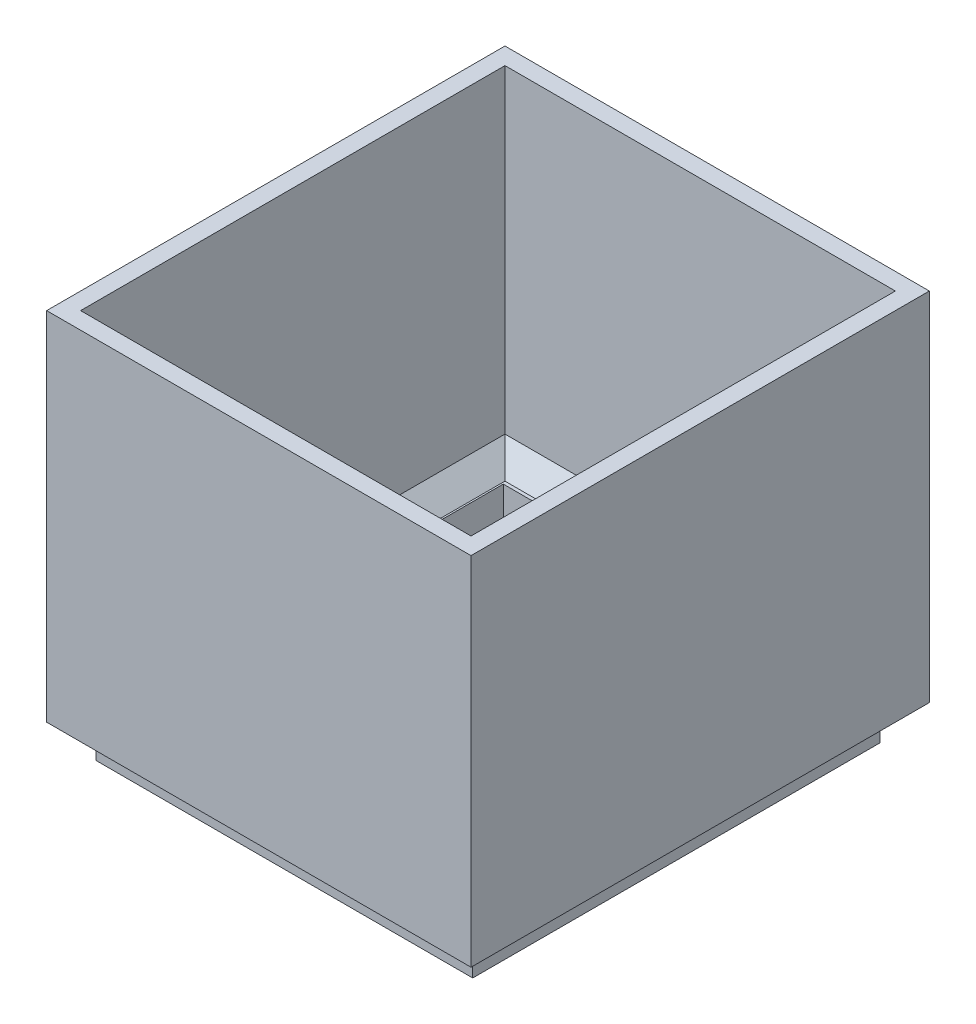
ISO-10303-21;
HEADER;
FILE_DESCRIPTION(('STEP AP214'),'2;1');
FILE_NAME('part.step','',(''),(''),'','','');
FILE_SCHEMA(('AUTOMOTIVE_DESIGN { 1 0 10303 214 1 1 1 1 }'));
ENDSEC;
DATA;
#1=APPLICATION_CONTEXT('core data for automotive mechanical design processes');
#2=APPLICATION_PROTOCOL_DEFINITION('international standard','automotive_design',2000,#1);
#3=PRODUCT_CONTEXT('',#1,'mechanical');
#4=PRODUCT('Part','Part','',(#3));
#5=PRODUCT_RELATED_PRODUCT_CATEGORY('part','',(#4));
#6=PRODUCT_DEFINITION_FORMATION('','',#4);
#7=PRODUCT_DEFINITION_CONTEXT('part definition',#1,'design');
#8=PRODUCT_DEFINITION('design','',#6,#7);
#9=PRODUCT_DEFINITION_SHAPE('','',#8);
#10=(LENGTH_UNIT() NAMED_UNIT(*) SI_UNIT(.MILLI.,.METRE.));
#11=(NAMED_UNIT(*) PLANE_ANGLE_UNIT() SI_UNIT($,.RADIAN.));
#12=(NAMED_UNIT(*) SI_UNIT($,.STERADIAN.) SOLID_ANGLE_UNIT());
#13=UNCERTAINTY_MEASURE_WITH_UNIT(LENGTH_MEASURE(1.E-05),#10,'distance_accuracy_value','');
#14=(GEOMETRIC_REPRESENTATION_CONTEXT(3) GLOBAL_UNCERTAINTY_ASSIGNED_CONTEXT((#13)) GLOBAL_UNIT_ASSIGNED_CONTEXT((#10,
#11,#12)) REPRESENTATION_CONTEXT('',''));
#15=CARTESIAN_POINT('',(0.,0.,0.));
#16=DIRECTION('',(0.,0.,1.));
#17=DIRECTION('',(1.,0.,0.));
#18=AXIS2_PLACEMENT_3D('',#15,#16,#17);
#19=CARTESIAN_POINT('',(0.,15.,0.));
#20=DIRECTION('',(0.,1.,0.));
#21=DIRECTION('',(0.,0.,1.));
#22=AXIS2_PLACEMENT_3D('',#19,#20,#21);
#23=PLANE('',#22);
#24=DIRECTION('',(1.,0.,0.));
#25=VECTOR('',#24,1.);
#26=CARTESIAN_POINT('',(57.5,15.,56.5));
#27=LINE('',#26,#25);
#28=CARTESIAN_POINT('',(-51.5,15.,56.5));
#29=VERTEX_POINT('',#28);
#30=CARTESIAN_POINT('',(51.5,15.,56.5));
#31=VERTEX_POINT('',#30);
#32=EDGE_CURVE('E347',#29,#31,#27,.T.);
#33=ORIENTED_EDGE('',*,*,#32,.T.);
#34=DIRECTION('',(0.,0.,-1.));
#35=VECTOR('',#34,1.);
#36=CARTESIAN_POINT('',(51.5,15.,-62.5));
#37=LINE('',#36,#35);
#38=CARTESIAN_POINT('',(51.5,15.,-56.5));
#39=VERTEX_POINT('',#38);
#40=EDGE_CURVE('E350',#31,#39,#37,.T.);
#41=ORIENTED_EDGE('',*,*,#40,.T.);
#42=DIRECTION('',(-1.,0.,0.));
#43=VECTOR('',#42,1.);
#44=CARTESIAN_POINT('',(-57.5,15.,-56.5));
#45=LINE('',#44,#43);
#46=CARTESIAN_POINT('',(-51.5,15.,-56.5));
#47=VERTEX_POINT('',#46);
#48=EDGE_CURVE('E341',#39,#47,#45,.T.);
#49=ORIENTED_EDGE('',*,*,#48,.T.);
#50=DIRECTION('',(0.,0.,1.));
#51=VECTOR('',#50,1.);
#52=CARTESIAN_POINT('',(-51.5,15.,62.5));
#53=LINE('',#52,#51);
#54=EDGE_CURVE('E344',#47,#29,#53,.T.);
#55=ORIENTED_EDGE('',*,*,#54,.T.);
#56=EDGE_LOOP('',(#33,#41,#49,#55));
#57=FACE_BOUND('',#56,.T.);
#58=DIRECTION('',(-1.,0.,0.));
#59=VECTOR('',#58,1.);
#60=CARTESIAN_POINT('',(-51.,15.,-55.5));
#61=LINE('',#60,#59);
#62=CARTESIAN_POINT('',(51.,15.,-55.5));
#63=VERTEX_POINT('',#62);
#64=CARTESIAN_POINT('',(-51.,15.,-55.5));
#65=VERTEX_POINT('',#64);
#66=EDGE_CURVE('E225',#63,#65,#61,.T.);
#67=ORIENTED_EDGE('',*,*,#66,.F.);
#68=DIRECTION('',(0.,0.,-1.));
#69=VECTOR('',#68,1.);
#70=CARTESIAN_POINT('',(51.,15.,-55.5));
#71=LINE('',#70,#69);
#72=CARTESIAN_POINT('',(51.,15.,55.5));
#73=VERTEX_POINT('',#72);
#74=EDGE_CURVE('E221',#73,#63,#71,.T.);
#75=ORIENTED_EDGE('',*,*,#74,.F.);
#76=DIRECTION('',(1.,0.,0.));
#77=VECTOR('',#76,1.);
#78=CARTESIAN_POINT('',(-51.,15.,55.5));
#79=LINE('',#78,#77);
#80=CARTESIAN_POINT('',(-51.,15.,55.5));
#81=VERTEX_POINT('',#80);
#82=EDGE_CURVE('E233',#81,#73,#79,.T.);
#83=ORIENTED_EDGE('',*,*,#82,.F.);
#84=DIRECTION('',(0.,0.,1.));
#85=VECTOR('',#84,1.);
#86=CARTESIAN_POINT('',(-51.,15.,-55.5));
#87=LINE('',#86,#85);
#88=EDGE_CURVE('E229',#65,#81,#87,.T.);
#89=ORIENTED_EDGE('',*,*,#88,.F.);
#90=EDGE_LOOP('',(#67,#75,#83,#89));
#91=FACE_BOUND('',#90,.T.);
#92=ADVANCED_FACE('F42',(#57,#91),#23,.T.);
#93=CARTESIAN_POINT('',(0.,0.,0.));
#94=DIRECTION('',(0.,1.,0.));
#95=DIRECTION('',(0.,0.,1.));
#96=AXIS2_PLACEMENT_3D('',#93,#94,#95);
#97=PLANE('',#96);
#98=DIRECTION('',(0.,0.,-1.));
#99=VECTOR('',#98,1.);
#100=CARTESIAN_POINT('',(55.5,0.,-60.));
#101=LINE('',#100,#99);
#102=CARTESIAN_POINT('',(55.5,0.,60.));
#103=VERTEX_POINT('',#102);
#104=CARTESIAN_POINT('',(55.5,0.,-60.));
#105=VERTEX_POINT('',#104);
#106=EDGE_CURVE('E296',#103,#105,#101,.T.);
#107=ORIENTED_EDGE('',*,*,#106,.F.);
#108=DIRECTION('',(1.,0.,0.));
#109=VECTOR('',#108,1.);
#110=CARTESIAN_POINT('',(-55.5,0.,60.));
#111=LINE('',#110,#109);
#112=CARTESIAN_POINT('',(-55.5,0.,60.));
#113=VERTEX_POINT('',#112);
#114=EDGE_CURVE('E302',#113,#103,#111,.T.);
#115=ORIENTED_EDGE('',*,*,#114,.F.);
#116=DIRECTION('',(0.,0.,1.));
#117=VECTOR('',#116,1.);
#118=CARTESIAN_POINT('',(-55.5,0.,-60.));
#119=LINE('',#118,#117);
#120=CARTESIAN_POINT('',(-55.5,0.,-60.));
#121=VERTEX_POINT('',#120);
#122=EDGE_CURVE('E321',#121,#113,#119,.T.);
#123=ORIENTED_EDGE('',*,*,#122,.F.);
#124=DIRECTION('',(-1.,0.,0.));
#125=VECTOR('',#124,1.);
#126=CARTESIAN_POINT('',(-55.5,0.,-60.));
#127=LINE('',#126,#125);
#128=EDGE_CURVE('E318',#105,#121,#127,.T.);
#129=ORIENTED_EDGE('',*,*,#128,.F.);
#130=EDGE_LOOP('',(#107,#115,#123,#129));
#131=FACE_BOUND('',#130,.T.);
#132=DIRECTION('',(0.,0.,-1.));
#133=VECTOR('',#132,1.);
#134=CARTESIAN_POINT('',(51.,0.,-55.5));
#135=LINE('',#134,#133);
#136=CARTESIAN_POINT('',(51.,0.,55.5));
#137=VERTEX_POINT('',#136);
#138=CARTESIAN_POINT('',(51.,0.,-55.5));
#139=VERTEX_POINT('',#138);
#140=EDGE_CURVE('E266',#137,#139,#135,.T.);
#141=ORIENTED_EDGE('',*,*,#140,.T.);
#142=DIRECTION('',(-1.,0.,0.));
#143=VECTOR('',#142,1.);
#144=CARTESIAN_POINT('',(-51.,0.,-55.5));
#145=LINE('',#144,#143);
#146=CARTESIAN_POINT('',(-51.,0.,-55.5));
#147=VERTEX_POINT('',#146);
#148=EDGE_CURVE('E270',#139,#147,#145,.T.);
#149=ORIENTED_EDGE('',*,*,#148,.T.);
#150=DIRECTION('',(0.,0.,1.));
#151=VECTOR('',#150,1.);
#152=CARTESIAN_POINT('',(-51.,0.,-55.5));
#153=LINE('',#152,#151);
#154=CARTESIAN_POINT('',(-51.,0.,55.5));
#155=VERTEX_POINT('',#154);
#156=EDGE_CURVE('E274',#147,#155,#153,.T.);
#157=ORIENTED_EDGE('',*,*,#156,.T.);
#158=DIRECTION('',(1.,0.,0.));
#159=VECTOR('',#158,1.);
#160=CARTESIAN_POINT('',(-51.,0.,55.5));
#161=LINE('',#160,#159);
#162=EDGE_CURVE('E278',#155,#137,#161,.T.);
#163=ORIENTED_EDGE('',*,*,#162,.T.);
#164=EDGE_LOOP('',(#141,#149,#157,#163));
#165=FACE_BOUND('',#164,.T.);
#166=ADVANCED_FACE('F396',(#131,#165),#97,.F.);
#167=CARTESIAN_POINT('',(55.5,10.,-60.));
#168=DIRECTION('',(-1.,0.,0.));
#169=DIRECTION('',(0.,0.,1.));
#170=AXIS2_PLACEMENT_3D('',#167,#168,#169);
#171=PLANE('',#170);
#172=ORIENTED_EDGE('',*,*,#106,.T.);
#173=DIRECTION('',(0.,-1.,0.));
#174=VECTOR('',#173,1.);
#175=CARTESIAN_POINT('',(55.5,10.,-60.));
#176=LINE('',#175,#174);
#177=CARTESIAN_POINT('',(55.5,10.,-60.));
#178=VERTEX_POINT('',#177);
#179=EDGE_CURVE('E337',#178,#105,#176,.T.);
#180=ORIENTED_EDGE('',*,*,#179,.F.);
#181=DIRECTION('',(0.,0.,-1.));
#182=VECTOR('',#181,1.);
#183=CARTESIAN_POINT('',(55.5,10.,-60.));
#184=LINE('',#183,#182);
#185=CARTESIAN_POINT('',(55.5,10.,60.));
#186=VERTEX_POINT('',#185);
#187=EDGE_CURVE('E297',#186,#178,#184,.T.);
#188=ORIENTED_EDGE('',*,*,#187,.F.);
#189=DIRECTION('',(0.,-1.,0.));
#190=VECTOR('',#189,1.);
#191=CARTESIAN_POINT('',(55.5,10.,60.));
#192=LINE('',#191,#190);
#193=EDGE_CURVE('E314',#186,#103,#192,.T.);
#194=ORIENTED_EDGE('',*,*,#193,.T.);
#195=EDGE_LOOP('',(#172,#180,#188,#194));
#196=FACE_BOUND('',#195,.T.);
#197=ADVANCED_FACE('F414',(#196),#171,.F.);
#198=CARTESIAN_POINT('',(-55.5,10.,-60.));
#199=DIRECTION('',(0.,0.,1.));
#200=DIRECTION('',(1.,0.,0.));
#201=AXIS2_PLACEMENT_3D('',#198,#199,#200);
#202=PLANE('',#201);
#203=ORIENTED_EDGE('',*,*,#128,.T.);
#204=DIRECTION('',(0.,-1.,0.));
#205=VECTOR('',#204,1.);
#206=CARTESIAN_POINT('',(-55.5,10.,-60.));
#207=LINE('',#206,#205);
#208=CARTESIAN_POINT('',(-55.5,10.,-60.));
#209=VERTEX_POINT('',#208);
#210=EDGE_CURVE('E333',#209,#121,#207,.T.);
#211=ORIENTED_EDGE('',*,*,#210,.F.);
#212=DIRECTION('',(-1.,0.,0.));
#213=VECTOR('',#212,1.);
#214=CARTESIAN_POINT('',(-55.5,10.,-60.));
#215=LINE('',#214,#213);
#216=EDGE_CURVE('E301',#178,#209,#215,.T.);
#217=ORIENTED_EDGE('',*,*,#216,.F.);
#218=ORIENTED_EDGE('',*,*,#179,.T.);
#219=EDGE_LOOP('',(#203,#211,#217,#218));
#220=FACE_BOUND('',#219,.T.);
#221=ADVANCED_FACE('F421',(#220),#202,.F.);
#222=CARTESIAN_POINT('',(-55.5,10.,-60.));
#223=DIRECTION('',(1.,0.,0.));
#224=DIRECTION('',(0.,0.,-1.));
#225=AXIS2_PLACEMENT_3D('',#222,#223,#224);
#226=PLANE('',#225);
#227=ORIENTED_EDGE('',*,*,#122,.T.);
#228=DIRECTION('',(0.,-1.,0.));
#229=VECTOR('',#228,1.);
#230=CARTESIAN_POINT('',(-55.5,10.,60.));
#231=LINE('',#230,#229);
#232=CARTESIAN_POINT('',(-55.5,10.,60.));
#233=VERTEX_POINT('',#232);
#234=EDGE_CURVE('E329',#233,#113,#231,.T.);
#235=ORIENTED_EDGE('',*,*,#234,.F.);
#236=DIRECTION('',(0.,0.,1.));
#237=VECTOR('',#236,1.);
#238=CARTESIAN_POINT('',(-55.5,10.,-60.));
#239=LINE('',#238,#237);
#240=EDGE_CURVE('E306',#209,#233,#239,.T.);
#241=ORIENTED_EDGE('',*,*,#240,.F.);
#242=ORIENTED_EDGE('',*,*,#210,.T.);
#243=EDGE_LOOP('',(#227,#235,#241,#242));
#244=FACE_BOUND('',#243,.T.);
#245=ADVANCED_FACE('F431',(#244),#226,.F.);
#246=CARTESIAN_POINT('',(-55.5,10.,60.));
#247=DIRECTION('',(0.,0.,-1.));
#248=DIRECTION('',(-1.,0.,0.));
#249=AXIS2_PLACEMENT_3D('',#246,#247,#248);
#250=PLANE('',#249);
#251=ORIENTED_EDGE('',*,*,#114,.T.);
#252=ORIENTED_EDGE('',*,*,#193,.F.);
#253=DIRECTION('',(1.,0.,0.));
#254=VECTOR('',#253,1.);
#255=CARTESIAN_POINT('',(-55.5,10.,60.));
#256=LINE('',#255,#254);
#257=EDGE_CURVE('E310',#233,#186,#256,.T.);
#258=ORIENTED_EDGE('',*,*,#257,.F.);
#259=ORIENTED_EDGE('',*,*,#234,.T.);
#260=EDGE_LOOP('',(#251,#252,#258,#259));
#261=FACE_BOUND('',#260,.T.);
#262=ADVANCED_FACE('F428',(#261),#250,.F.);
#263=CARTESIAN_POINT('',(51.,10.,-55.5));
#264=DIRECTION('',(-1.,0.,0.));
#265=DIRECTION('',(0.,0.,1.));
#266=AXIS2_PLACEMENT_3D('',#263,#264,#265);
#267=PLANE('',#266);
#268=ORIENTED_EDGE('',*,*,#140,.F.);
#269=DIRECTION('',(0.,-1.,0.));
#270=VECTOR('',#269,1.);
#271=CARTESIAN_POINT('',(51.,10.,55.5));
#272=LINE('',#271,#270);
#273=EDGE_CURVE('E282',#73,#137,#272,.T.);
#274=ORIENTED_EDGE('',*,*,#273,.F.);
#275=ORIENTED_EDGE('',*,*,#74,.T.);
#276=DIRECTION('',(0.,-1.,0.));
#277=VECTOR('',#276,1.);
#278=CARTESIAN_POINT('',(51.,10.,-55.5));
#279=LINE('',#278,#277);
#280=EDGE_CURVE('E292',#63,#139,#279,.T.);
#281=ORIENTED_EDGE('',*,*,#280,.T.);
#282=EDGE_LOOP('',(#268,#274,#275,#281));
#283=FACE_BOUND('',#282,.T.);
#284=ADVANCED_FACE('F406',(#283),#267,.T.);
#285=CARTESIAN_POINT('',(-51.,10.,-55.5));
#286=DIRECTION('',(0.,0.,1.));
#287=DIRECTION('',(1.,0.,0.));
#288=AXIS2_PLACEMENT_3D('',#285,#286,#287);
#289=PLANE('',#288);
#290=ORIENTED_EDGE('',*,*,#148,.F.);
#291=ORIENTED_EDGE('',*,*,#280,.F.);
#292=ORIENTED_EDGE('',*,*,#66,.T.);
#293=DIRECTION('',(0.,-1.,0.));
#294=VECTOR('',#293,1.);
#295=CARTESIAN_POINT('',(-51.,10.,-55.5));
#296=LINE('',#295,#294);
#297=EDGE_CURVE('E289',#65,#147,#296,.T.);
#298=ORIENTED_EDGE('',*,*,#297,.T.);
#299=EDGE_LOOP('',(#290,#291,#292,#298));
#300=FACE_BOUND('',#299,.T.);
#301=ADVANCED_FACE('F403',(#300),#289,.T.);
#302=CARTESIAN_POINT('',(-51.,10.,-55.5));
#303=DIRECTION('',(1.,0.,0.));
#304=DIRECTION('',(0.,0.,-1.));
#305=AXIS2_PLACEMENT_3D('',#302,#303,#304);
#306=PLANE('',#305);
#307=ORIENTED_EDGE('',*,*,#156,.F.);
#308=ORIENTED_EDGE('',*,*,#297,.F.);
#309=ORIENTED_EDGE('',*,*,#88,.T.);
#310=DIRECTION('',(0.,-1.,0.));
#311=VECTOR('',#310,1.);
#312=CARTESIAN_POINT('',(-51.,10.,55.5));
#313=LINE('',#312,#311);
#314=EDGE_CURVE('E286',#81,#155,#313,.T.);
#315=ORIENTED_EDGE('',*,*,#314,.T.);
#316=EDGE_LOOP('',(#307,#308,#309,#315));
#317=FACE_BOUND('',#316,.T.);
#318=ADVANCED_FACE('F411',(#317),#306,.T.);
#319=CARTESIAN_POINT('',(-51.,10.,55.5));
#320=DIRECTION('',(0.,0.,-1.));
#321=DIRECTION('',(-1.,0.,0.));
#322=AXIS2_PLACEMENT_3D('',#319,#320,#321);
#323=PLANE('',#322);
#324=ORIENTED_EDGE('',*,*,#162,.F.);
#325=ORIENTED_EDGE('',*,*,#314,.F.);
#326=ORIENTED_EDGE('',*,*,#82,.T.);
#327=ORIENTED_EDGE('',*,*,#273,.T.);
#328=EDGE_LOOP('',(#324,#325,#326,#327));
#329=FACE_BOUND('',#328,.T.);
#330=ADVANCED_FACE('F409',(#329),#323,.T.);
#331=CARTESIAN_POINT('',(0.,10.,0.));
#332=DIRECTION('',(0.,1.,0.));
#333=DIRECTION('',(0.,0.,1.));
#334=AXIS2_PLACEMENT_3D('',#331,#332,#333);
#335=PLANE('',#334);
#336=DIRECTION('',(0.,0.,-1.));
#337=VECTOR('',#336,1.);
#338=CARTESIAN_POINT('',(62.5,10.,-67.5));
#339=LINE('',#338,#337);
#340=CARTESIAN_POINT('',(62.5,10.,67.5));
#341=VERTEX_POINT('',#340);
#342=CARTESIAN_POINT('',(62.5,10.,-67.5));
#343=VERTEX_POINT('',#342);
#344=EDGE_CURVE('E237',#341,#343,#339,.T.);
#345=ORIENTED_EDGE('',*,*,#344,.F.);
#346=DIRECTION('',(1.,0.,0.));
#347=VECTOR('',#346,1.);
#348=CARTESIAN_POINT('',(-62.5,10.,67.5));
#349=LINE('',#348,#347);
#350=CARTESIAN_POINT('',(-62.5,10.,67.5));
#351=VERTEX_POINT('',#350);
#352=EDGE_CURVE('E247',#351,#341,#349,.T.);
#353=ORIENTED_EDGE('',*,*,#352,.F.);
#354=DIRECTION('',(0.,0.,1.));
#355=VECTOR('',#354,1.);
#356=CARTESIAN_POINT('',(-62.5,10.,-67.5));
#357=LINE('',#356,#355);
#358=CARTESIAN_POINT('',(-62.5,10.,-67.5));
#359=VERTEX_POINT('',#358);
#360=EDGE_CURVE('E244',#359,#351,#357,.T.);
#361=ORIENTED_EDGE('',*,*,#360,.F.);
#362=DIRECTION('',(-1.,0.,0.));
#363=VECTOR('',#362,1.);
#364=CARTESIAN_POINT('',(-62.5,10.,-67.5));
#365=LINE('',#364,#363);
#366=EDGE_CURVE('E241',#343,#359,#365,.T.);
#367=ORIENTED_EDGE('',*,*,#366,.F.);
#368=EDGE_LOOP('',(#345,#353,#361,#367));
#369=FACE_BOUND('',#368,.T.);
#370=ORIENTED_EDGE('',*,*,#257,.T.);
#371=ORIENTED_EDGE('',*,*,#187,.T.);
#372=ORIENTED_EDGE('',*,*,#216,.T.);
#373=ORIENTED_EDGE('',*,*,#240,.T.);
#374=EDGE_LOOP('',(#370,#371,#372,#373));
#375=FACE_BOUND('',#374,.T.);
#376=ADVANCED_FACE('F472',(#369,#375),#335,.F.);
#377=CARTESIAN_POINT('',(62.5,15.,-67.5));
#378=DIRECTION('',(-1.,0.,0.));
#379=DIRECTION('',(0.,0.,1.));
#380=AXIS2_PLACEMENT_3D('',#377,#378,#379);
#381=PLANE('',#380);
#382=ORIENTED_EDGE('',*,*,#344,.T.);
#383=DIRECTION('',(0.,-1.,0.));
#384=VECTOR('',#383,1.);
#385=CARTESIAN_POINT('',(62.5,15.,-67.5));
#386=LINE('',#385,#384);
#387=CARTESIAN_POINT('',(62.5,115.,-67.5));
#388=VERTEX_POINT('',#387);
#389=EDGE_CURVE('E262',#388,#343,#386,.T.);
#390=ORIENTED_EDGE('',*,*,#389,.F.);
#391=DIRECTION('',(0.,0.,-1.));
#392=VECTOR('',#391,1.);
#393=CARTESIAN_POINT('',(62.5,115.,-67.5));
#394=LINE('',#393,#392);
#395=CARTESIAN_POINT('',(62.5,115.,67.5));
#396=VERTEX_POINT('',#395);
#397=EDGE_CURVE('E213',#396,#388,#394,.T.);
#398=ORIENTED_EDGE('',*,*,#397,.F.);
#399=DIRECTION('',(0.,-1.,0.));
#400=VECTOR('',#399,1.);
#401=CARTESIAN_POINT('',(62.5,15.,67.5));
#402=LINE('',#401,#400);
#403=EDGE_CURVE('E250',#396,#341,#402,.T.);
#404=ORIENTED_EDGE('',*,*,#403,.T.);
#405=EDGE_LOOP('',(#382,#390,#398,#404));
#406=FACE_BOUND('',#405,.T.);
#407=ADVANCED_FACE('F475',(#406),#381,.F.);
#408=CARTESIAN_POINT('',(-62.5,15.,-67.5));
#409=DIRECTION('',(0.,0.,1.));
#410=DIRECTION('',(1.,0.,0.));
#411=AXIS2_PLACEMENT_3D('',#408,#409,#410);
#412=PLANE('',#411);
#413=ORIENTED_EDGE('',*,*,#366,.T.);
#414=DIRECTION('',(0.,-1.,0.));
#415=VECTOR('',#414,1.);
#416=CARTESIAN_POINT('',(-62.5,15.,-67.5));
#417=LINE('',#416,#415);
#418=CARTESIAN_POINT('',(-62.5,115.,-67.5));
#419=VERTEX_POINT('',#418);
#420=EDGE_CURVE('E258',#419,#359,#417,.T.);
#421=ORIENTED_EDGE('',*,*,#420,.F.);
#422=DIRECTION('',(-1.,0.,0.));
#423=VECTOR('',#422,1.);
#424=CARTESIAN_POINT('',(62.5,115.,-67.5));
#425=LINE('',#424,#423);
#426=EDGE_CURVE('E217',#388,#419,#425,.T.);
#427=ORIENTED_EDGE('',*,*,#426,.F.);
#428=ORIENTED_EDGE('',*,*,#389,.T.);
#429=EDGE_LOOP('',(#413,#421,#427,#428));
#430=FACE_BOUND('',#429,.T.);
#431=ADVANCED_FACE('F483',(#430),#412,.F.);
#432=CARTESIAN_POINT('',(-62.5,15.,-67.5));
#433=DIRECTION('',(1.,0.,0.));
#434=DIRECTION('',(0.,0.,-1.));
#435=AXIS2_PLACEMENT_3D('',#432,#433,#434);
#436=PLANE('',#435);
#437=ORIENTED_EDGE('',*,*,#360,.T.);
#438=DIRECTION('',(0.,-1.,0.));
#439=VECTOR('',#438,1.);
#440=CARTESIAN_POINT('',(-62.5,15.,67.5));
#441=LINE('',#440,#439);
#442=CARTESIAN_POINT('',(-62.5,115.,67.5));
#443=VERTEX_POINT('',#442);
#444=EDGE_CURVE('E254',#443,#351,#441,.T.);
#445=ORIENTED_EDGE('',*,*,#444,.F.);
#446=DIRECTION('',(0.,0.,1.));
#447=VECTOR('',#446,1.);
#448=CARTESIAN_POINT('',(-62.5,115.,-67.5));
#449=LINE('',#448,#447);
#450=EDGE_CURVE('E183',#419,#443,#449,.T.);
#451=ORIENTED_EDGE('',*,*,#450,.F.);
#452=ORIENTED_EDGE('',*,*,#420,.T.);
#453=EDGE_LOOP('',(#437,#445,#451,#452));
#454=FACE_BOUND('',#453,.T.);
#455=ADVANCED_FACE('F479',(#454),#436,.F.);
#456=CARTESIAN_POINT('',(-62.5,15.,67.5));
#457=DIRECTION('',(0.,0.,-1.));
#458=DIRECTION('',(-1.,0.,0.));
#459=AXIS2_PLACEMENT_3D('',#456,#457,#458);
#460=PLANE('',#459);
#461=ORIENTED_EDGE('',*,*,#352,.T.);
#462=ORIENTED_EDGE('',*,*,#403,.F.);
#463=DIRECTION('',(1.,0.,0.));
#464=VECTOR('',#463,1.);
#465=CARTESIAN_POINT('',(62.5,115.,67.5));
#466=LINE('',#465,#464);
#467=EDGE_CURVE('E209',#443,#396,#466,.T.);
#468=ORIENTED_EDGE('',*,*,#467,.F.);
#469=ORIENTED_EDGE('',*,*,#444,.T.);
#470=EDGE_LOOP('',(#461,#462,#468,#469));
#471=FACE_BOUND('',#470,.T.);
#472=ADVANCED_FACE('F469',(#471),#460,.F.);
#473=CARTESIAN_POINT('',(0.,115.,0.));
#474=DIRECTION('',(0.,-1.,0.));
#475=DIRECTION('',(0.,0.,-1.));
#476=AXIS2_PLACEMENT_3D('',#473,#474,#475);
#477=PLANE('',#476);
#478=ORIENTED_EDGE('',*,*,#450,.T.);
#479=ORIENTED_EDGE('',*,*,#467,.T.);
#480=ORIENTED_EDGE('',*,*,#397,.T.);
#481=ORIENTED_EDGE('',*,*,#426,.T.);
#482=EDGE_LOOP('',(#478,#479,#480,#481));
#483=FACE_BOUND('',#482,.T.);
#484=DIRECTION('',(0.,0.,1.));
#485=VECTOR('',#484,1.);
#486=CARTESIAN_POINT('',(-57.5,115.,-62.5));
#487=LINE('',#486,#485);
#488=CARTESIAN_POINT('',(-57.5,115.,-62.5));
#489=VERTEX_POINT('',#488);
#490=CARTESIAN_POINT('',(-57.5,115.,62.5));
#491=VERTEX_POINT('',#490);
#492=EDGE_CURVE('E170',#489,#491,#487,.T.);
#493=ORIENTED_EDGE('',*,*,#492,.F.);
#494=DIRECTION('',(-1.,0.,0.));
#495=VECTOR('',#494,1.);
#496=CARTESIAN_POINT('',(57.5,115.,-62.5));
#497=LINE('',#496,#495);
#498=CARTESIAN_POINT('',(57.5,115.,-62.5));
#499=VERTEX_POINT('',#498);
#500=EDGE_CURVE('E193',#499,#489,#497,.T.);
#501=ORIENTED_EDGE('',*,*,#500,.F.);
#502=DIRECTION('',(0.,0.,-1.));
#503=VECTOR('',#502,1.);
#504=CARTESIAN_POINT('',(57.5,115.,-62.5));
#505=LINE('',#504,#503);
#506=CARTESIAN_POINT('',(57.5,115.,62.5));
#507=VERTEX_POINT('',#506);
#508=EDGE_CURVE('E189',#507,#499,#505,.T.);
#509=ORIENTED_EDGE('',*,*,#508,.F.);
#510=DIRECTION('',(1.,0.,0.));
#511=VECTOR('',#510,1.);
#512=CARTESIAN_POINT('',(57.5,115.,62.5));
#513=LINE('',#512,#511);
#514=EDGE_CURVE('E178',#491,#507,#513,.T.);
#515=ORIENTED_EDGE('',*,*,#514,.F.);
#516=EDGE_LOOP('',(#493,#501,#509,#515));
#517=FACE_BOUND('',#516,.T.);
#518=ADVANCED_FACE('F187',(#483,#517),#477,.F.);
#519=CARTESIAN_POINT('',(-57.5,115.,-62.5));
#520=DIRECTION('',(1.,0.,0.));
#521=DIRECTION('',(0.,0.,-1.));
#522=AXIS2_PLACEMENT_3D('',#519,#520,#521);
#523=PLANE('',#522);
#524=DIRECTION('',(0.,-1.,0.));
#525=VECTOR('',#524,1.);
#526=CARTESIAN_POINT('',(-57.5,115.,62.5));
#527=LINE('',#526,#525);
#528=CARTESIAN_POINT('',(-57.5,21.,62.5));
#529=VERTEX_POINT('',#528);
#530=EDGE_CURVE('E172',#491,#529,#527,.T.);
#531=ORIENTED_EDGE('',*,*,#530,.T.);
#532=DIRECTION('',(0.,0.,-1.));
#533=VECTOR('',#532,1.);
#534=CARTESIAN_POINT('',(-57.5,21.,-62.5));
#535=LINE('',#534,#533);
#536=CARTESIAN_POINT('',(-57.5,21.,-62.5));
#537=VERTEX_POINT('',#536);
#538=EDGE_CURVE('E53',#529,#537,#535,.T.);
#539=ORIENTED_EDGE('',*,*,#538,.T.);
#540=DIRECTION('',(0.,-1.,0.));
#541=VECTOR('',#540,1.);
#542=CARTESIAN_POINT('',(-57.5,115.,-62.5));
#543=LINE('',#542,#541);
#544=EDGE_CURVE('E173',#489,#537,#543,.T.);
#545=ORIENTED_EDGE('',*,*,#544,.F.);
#546=ORIENTED_EDGE('',*,*,#492,.T.);
#547=EDGE_LOOP('',(#531,#539,#545,#546));
#548=FACE_BOUND('',#547,.T.);
#549=ADVANCED_FACE('F171',(#548),#523,.T.);
#550=CARTESIAN_POINT('',(57.5,115.,62.5));
#551=DIRECTION('',(0.,0.,-1.));
#552=DIRECTION('',(-1.,0.,0.));
#553=AXIS2_PLACEMENT_3D('',#550,#551,#552);
#554=PLANE('',#553);
#555=DIRECTION('',(0.,-1.,0.));
#556=VECTOR('',#555,1.);
#557=CARTESIAN_POINT('',(57.5,115.,62.5));
#558=LINE('',#557,#556);
#559=CARTESIAN_POINT('',(57.5,21.,62.5));
#560=VERTEX_POINT('',#559);
#561=EDGE_CURVE('E184',#507,#560,#558,.T.);
#562=ORIENTED_EDGE('',*,*,#561,.T.);
#563=DIRECTION('',(-1.,0.,0.));
#564=VECTOR('',#563,1.);
#565=CARTESIAN_POINT('',(-57.5,21.,62.5));
#566=LINE('',#565,#564);
#567=EDGE_CURVE('E68',#560,#529,#566,.T.);
#568=ORIENTED_EDGE('',*,*,#567,.T.);
#569=ORIENTED_EDGE('',*,*,#530,.F.);
#570=ORIENTED_EDGE('',*,*,#514,.T.);
#571=EDGE_LOOP('',(#562,#568,#569,#570));
#572=FACE_BOUND('',#571,.T.);
#573=ADVANCED_FACE('F180',(#572),#554,.T.);
#574=CARTESIAN_POINT('',(57.5,115.,-62.5));
#575=DIRECTION('',(-1.,0.,0.));
#576=DIRECTION('',(0.,0.,1.));
#577=AXIS2_PLACEMENT_3D('',#574,#575,#576);
#578=PLANE('',#577);
#579=DIRECTION('',(0.,-1.,0.));
#580=VECTOR('',#579,1.);
#581=CARTESIAN_POINT('',(57.5,115.,-62.5));
#582=LINE('',#581,#580);
#583=CARTESIAN_POINT('',(57.5,21.,-62.5));
#584=VERTEX_POINT('',#583);
#585=EDGE_CURVE('E200',#499,#584,#582,.T.);
#586=ORIENTED_EDGE('',*,*,#585,.T.);
#587=DIRECTION('',(0.,0.,1.));
#588=VECTOR('',#587,1.);
#589=CARTESIAN_POINT('',(57.5,21.,62.5));
#590=LINE('',#589,#588);
#591=EDGE_CURVE('E354',#584,#560,#590,.T.);
#592=ORIENTED_EDGE('',*,*,#591,.T.);
#593=ORIENTED_EDGE('',*,*,#561,.F.);
#594=ORIENTED_EDGE('',*,*,#508,.T.);
#595=EDGE_LOOP('',(#586,#592,#593,#594));
#596=FACE_BOUND('',#595,.T.);
#597=ADVANCED_FACE('F389',(#596),#578,.T.);
#598=CARTESIAN_POINT('',(57.5,115.,-62.5));
#599=DIRECTION('',(0.,0.,1.));
#600=DIRECTION('',(1.,0.,0.));
#601=AXIS2_PLACEMENT_3D('',#598,#599,#600);
#602=PLANE('',#601);
#603=ORIENTED_EDGE('',*,*,#544,.T.);
#604=DIRECTION('',(1.,0.,0.));
#605=VECTOR('',#604,1.);
#606=CARTESIAN_POINT('',(57.5,21.,-62.5));
#607=LINE('',#606,#605);
#608=EDGE_CURVE('E11',#537,#584,#607,.T.);
#609=ORIENTED_EDGE('',*,*,#608,.T.);
#610=ORIENTED_EDGE('',*,*,#585,.F.);
#611=ORIENTED_EDGE('',*,*,#500,.T.);
#612=EDGE_LOOP('',(#603,#609,#610,#611));
#613=FACE_BOUND('',#612,.T.);
#614=ADVANCED_FACE('F386',(#613),#602,.T.);
#615=CARTESIAN_POINT('',(-51.5,15.,0.));
#616=DIRECTION('',(0.707106781186543,0.707106781186552,0.));
#617=DIRECTION('',(0.,0.,-1.));
#618=AXIS2_PLACEMENT_3D('',#615,#616,#617);
#619=PLANE('',#618);
#620=DIRECTION('',(0.577350269189628,-0.57735026918962,0.577350269189628));
#621=VECTOR('',#620,1.);
#622=CARTESIAN_POINT('',(-32.6666666666665,-3.83333333333324,-37.6666666666665));
#623=LINE('',#622,#621);
#624=EDGE_CURVE('E367',#537,#47,#623,.T.);
#625=ORIENTED_EDGE('',*,*,#624,.F.);
#626=ORIENTED_EDGE('',*,*,#538,.F.);
#627=DIRECTION('',(0.577350269189628,-0.57735026918962,-0.577350269189628));
#628=VECTOR('',#627,1.);
#629=CARTESIAN_POINT('',(-34.3333333333332,-2.16666666666658,39.3333333333332));
#630=LINE('',#629,#628);
#631=EDGE_CURVE('E47',#29,#529,#630,.F.);
#632=ORIENTED_EDGE('',*,*,#631,.F.);
#633=ORIENTED_EDGE('',*,*,#54,.F.);
#634=EDGE_LOOP('',(#625,#626,#632,#633));
#635=FACE_BOUND('',#634,.T.);
#636=ADVANCED_FACE('F45',(#635),#619,.T.);
#637=CARTESIAN_POINT('',(0.,15.,56.5));
#638=DIRECTION('',(0.,0.707106781186552,-0.707106781186543));
#639=DIRECTION('',(-1.,0.,0.));
#640=AXIS2_PLACEMENT_3D('',#637,#638,#639);
#641=PLANE('',#640);
#642=ORIENTED_EDGE('',*,*,#631,.T.);
#643=ORIENTED_EDGE('',*,*,#567,.F.);
#644=DIRECTION('',(-0.577350269189628,-0.57735026918962,-0.577350269189628));
#645=VECTOR('',#644,1.);
#646=CARTESIAN_POINT('',(32.6666666666665,-3.83333333333324,37.6666666666665));
#647=LINE('',#646,#645);
#648=EDGE_CURVE('E365',#31,#560,#647,.F.);
#649=ORIENTED_EDGE('',*,*,#648,.F.);
#650=ORIENTED_EDGE('',*,*,#32,.F.);
#651=EDGE_LOOP('',(#642,#643,#649,#650));
#652=FACE_BOUND('',#651,.T.);
#653=ADVANCED_FACE('F379',(#652),#641,.T.);
#654=CARTESIAN_POINT('',(0.,15.,-56.5));
#655=DIRECTION('',(0.,0.707106781186552,0.707106781186543));
#656=DIRECTION('',(1.,0.,0.));
#657=AXIS2_PLACEMENT_3D('',#654,#655,#656);
#658=PLANE('',#657);
#659=ORIENTED_EDGE('',*,*,#624,.T.);
#660=ORIENTED_EDGE('',*,*,#48,.F.);
#661=DIRECTION('',(0.577350269189628,0.57735026918962,-0.577350269189628));
#662=VECTOR('',#661,1.);
#663=CARTESIAN_POINT('',(32.6666666666665,-3.83333333333324,-37.6666666666665));
#664=LINE('',#663,#662);
#665=EDGE_CURVE('E362',#584,#39,#664,.F.);
#666=ORIENTED_EDGE('',*,*,#665,.F.);
#667=ORIENTED_EDGE('',*,*,#608,.F.);
#668=EDGE_LOOP('',(#659,#660,#666,#667));
#669=FACE_BOUND('',#668,.T.);
#670=ADVANCED_FACE('F384',(#669),#658,.T.);
#671=CARTESIAN_POINT('',(51.5,15.,0.));
#672=DIRECTION('',(-0.707106781186543,0.707106781186552,0.));
#673=DIRECTION('',(0.,0.,1.));
#674=AXIS2_PLACEMENT_3D('',#671,#672,#673);
#675=PLANE('',#674);
#676=ORIENTED_EDGE('',*,*,#648,.T.);
#677=ORIENTED_EDGE('',*,*,#591,.F.);
#678=ORIENTED_EDGE('',*,*,#665,.T.);
#679=ORIENTED_EDGE('',*,*,#40,.F.);
#680=EDGE_LOOP('',(#676,#677,#678,#679));
#681=FACE_BOUND('',#680,.T.);
#682=ADVANCED_FACE('F391',(#681),#675,.T.);
#683=CLOSED_SHELL('',(#92,#166,#197,#221,#245,#262,#284,#301,#318,#330,#376,#407,#431,#455,#472,
#518,#549,#573,#597,#614,#636,#653,#670,#682));
#684=MANIFOLD_SOLID_BREP('B2',#683);
#685=ADVANCED_BREP_SHAPE_REPRESENTATION('',(#18,#684),#14);
#686=SHAPE_DEFINITION_REPRESENTATION(#9,#685);
ENDSEC;
END-ISO-10303-21;
